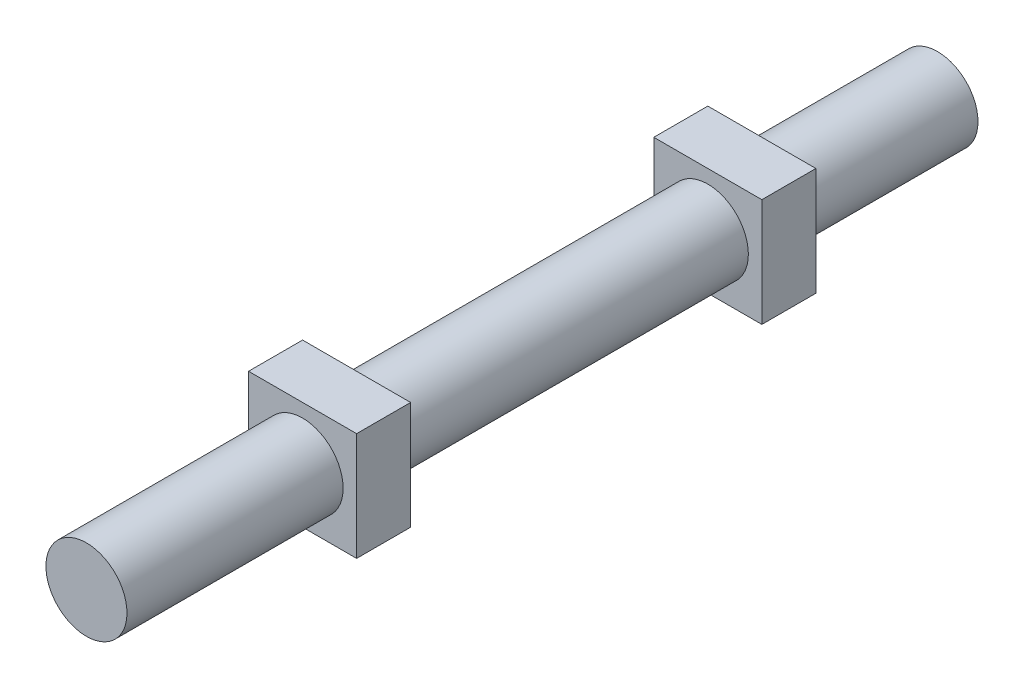
ISO-10303-21;
HEADER;
FILE_DESCRIPTION(('STEP AP214'),'2;1');
FILE_NAME('part.step','',(''),(''),'','','');
FILE_SCHEMA(('AUTOMOTIVE_DESIGN { 1 0 10303 214 1 1 1 1 }'));
ENDSEC;
DATA;
#1=APPLICATION_CONTEXT('core data for automotive mechanical design processes');
#2=APPLICATION_PROTOCOL_DEFINITION('international standard','automotive_design',2000,#1);
#3=PRODUCT_CONTEXT('',#1,'mechanical');
#4=PRODUCT('Part','Part','',(#3));
#5=PRODUCT_RELATED_PRODUCT_CATEGORY('part','',(#4));
#6=PRODUCT_DEFINITION_FORMATION('','',#4);
#7=PRODUCT_DEFINITION_CONTEXT('part definition',#1,'design');
#8=PRODUCT_DEFINITION('design','',#6,#7);
#9=PRODUCT_DEFINITION_SHAPE('','',#8);
#10=(LENGTH_UNIT() NAMED_UNIT(*) SI_UNIT(.MILLI.,.METRE.));
#11=(NAMED_UNIT(*) PLANE_ANGLE_UNIT() SI_UNIT($,.RADIAN.));
#12=(NAMED_UNIT(*) SI_UNIT($,.STERADIAN.) SOLID_ANGLE_UNIT());
#13=UNCERTAINTY_MEASURE_WITH_UNIT(LENGTH_MEASURE(1.E-05),#10,'distance_accuracy_value','');
#14=(GEOMETRIC_REPRESENTATION_CONTEXT(3) GLOBAL_UNCERTAINTY_ASSIGNED_CONTEXT((#13)) GLOBAL_UNIT_ASSIGNED_CONTEXT((#10,
#11,#12)) REPRESENTATION_CONTEXT('',''));
#15=CARTESIAN_POINT('',(0.,0.,0.));
#16=DIRECTION('',(0.,0.,1.));
#17=DIRECTION('',(1.,0.,0.));
#18=AXIS2_PLACEMENT_3D('',#15,#16,#17);
#19=CARTESIAN_POINT('',(0.,0.,157.5));
#20=DIRECTION('',(0.,0.,-1.));
#21=DIRECTION('',(-1.,0.,0.));
#22=AXIS2_PLACEMENT_3D('',#19,#20,#21);
#23=CYLINDRICAL_SURFACE('',#22,7.5);
#24=CARTESIAN_POINT('',(0.,0.,117.5));
#25=DIRECTION('',(0.,0.,1.));
#26=DIRECTION('',(1.,0.,0.));
#27=AXIS2_PLACEMENT_3D('',#24,#25,#26);
#28=CIRCLE('',#27,7.5);
#29=CARTESIAN_POINT('',(7.5,0.,117.5));
#30=VERTEX_POINT('',#29);
#31=EDGE_CURVE('E171',#30,#30,#28,.T.);
#32=ORIENTED_EDGE('',*,*,#31,.T.);
#33=EDGE_LOOP('',(#32));
#34=FACE_BOUND('',#33,.T.);
#35=CARTESIAN_POINT('',(0.,0.,157.5));
#36=DIRECTION('',(0.,0.,1.));
#37=DIRECTION('',(1.,0.,0.));
#38=AXIS2_PLACEMENT_3D('',#35,#36,#37);
#39=CIRCLE('',#38,7.5);
#40=CARTESIAN_POINT('',(7.5,0.,157.5));
#41=VERTEX_POINT('',#40);
#42=EDGE_CURVE('E172',#41,#41,#39,.T.);
#43=ORIENTED_EDGE('',*,*,#42,.F.);
#44=EDGE_LOOP('',(#43));
#45=FACE_BOUND('',#44,.T.);
#46=ADVANCED_FACE('F43',(#34,#45),#23,.T.);
#47=CARTESIAN_POINT('',(0.,0.,157.5));
#48=DIRECTION('',(0.,0.,1.));
#49=DIRECTION('',(1.,0.,0.));
#50=AXIS2_PLACEMENT_3D('',#47,#48,#49);
#51=PLANE('',#50);
#52=ORIENTED_EDGE('',*,*,#42,.T.);
#53=EDGE_LOOP('',(#52));
#54=FACE_BOUND('',#53,.T.);
#55=ADVANCED_FACE('F211',(#54),#51,.T.);
#56=CARTESIAN_POINT('',(10.,10.,117.5));
#57=DIRECTION('',(-1.,0.,0.));
#58=DIRECTION('',(0.,0.,1.));
#59=AXIS2_PLACEMENT_3D('',#56,#57,#58);
#60=PLANE('',#59);
#61=DIRECTION('',(0.,1.,0.));
#62=VECTOR('',#61,1.);
#63=CARTESIAN_POINT('',(10.,10.,107.5));
#64=LINE('',#63,#62);
#65=CARTESIAN_POINT('',(10.,-10.,107.5));
#66=VERTEX_POINT('',#65);
#67=CARTESIAN_POINT('',(10.,10.,107.5));
#68=VERTEX_POINT('',#67);
#69=EDGE_CURVE('E146',#66,#68,#64,.T.);
#70=ORIENTED_EDGE('',*,*,#69,.T.);
#71=DIRECTION('',(0.,0.,-1.));
#72=VECTOR('',#71,1.);
#73=CARTESIAN_POINT('',(10.,10.,117.5));
#74=LINE('',#73,#72);
#75=CARTESIAN_POINT('',(10.,10.,117.5));
#76=VERTEX_POINT('',#75);
#77=EDGE_CURVE('E169',#76,#68,#74,.T.);
#78=ORIENTED_EDGE('',*,*,#77,.F.);
#79=DIRECTION('',(0.,1.,0.));
#80=VECTOR('',#79,1.);
#81=CARTESIAN_POINT('',(10.,10.,117.5));
#82=LINE('',#81,#80);
#83=CARTESIAN_POINT('',(10.,-10.,117.5));
#84=VERTEX_POINT('',#83);
#85=EDGE_CURVE('E151',#84,#76,#82,.T.);
#86=ORIENTED_EDGE('',*,*,#85,.F.);
#87=DIRECTION('',(0.,0.,-1.));
#88=VECTOR('',#87,1.);
#89=CARTESIAN_POINT('',(10.,-10.,117.5));
#90=LINE('',#89,#88);
#91=EDGE_CURVE('E157',#84,#66,#90,.T.);
#92=ORIENTED_EDGE('',*,*,#91,.T.);
#93=EDGE_LOOP('',(#70,#78,#86,#92));
#94=FACE_BOUND('',#93,.T.);
#95=ADVANCED_FACE('F193',(#94),#60,.F.);
#96=CARTESIAN_POINT('',(-10.,10.,117.5));
#97=DIRECTION('',(0.,-1.,0.));
#98=DIRECTION('',(0.,0.,-1.));
#99=AXIS2_PLACEMENT_3D('',#96,#97,#98);
#100=PLANE('',#99);
#101=DIRECTION('',(-1.,0.,0.));
#102=VECTOR('',#101,1.);
#103=CARTESIAN_POINT('',(-10.,10.,107.5));
#104=LINE('',#103,#102);
#105=CARTESIAN_POINT('',(-10.,10.,107.5));
#106=VERTEX_POINT('',#105);
#107=EDGE_CURVE('E160',#68,#106,#104,.T.);
#108=ORIENTED_EDGE('',*,*,#107,.T.);
#109=DIRECTION('',(0.,0.,-1.));
#110=VECTOR('',#109,1.);
#111=CARTESIAN_POINT('',(-10.,10.,117.5));
#112=LINE('',#111,#110);
#113=CARTESIAN_POINT('',(-10.,10.,117.5));
#114=VERTEX_POINT('',#113);
#115=EDGE_CURVE('E167',#114,#106,#112,.T.);
#116=ORIENTED_EDGE('',*,*,#115,.F.);
#117=DIRECTION('',(-1.,0.,0.));
#118=VECTOR('',#117,1.);
#119=CARTESIAN_POINT('',(-10.,10.,117.5));
#120=LINE('',#119,#118);
#121=EDGE_CURVE('E92',#76,#114,#120,.T.);
#122=ORIENTED_EDGE('',*,*,#121,.F.);
#123=ORIENTED_EDGE('',*,*,#77,.T.);
#124=EDGE_LOOP('',(#108,#116,#122,#123));
#125=FACE_BOUND('',#124,.T.);
#126=ADVANCED_FACE('F195',(#125),#100,.F.);
#127=CARTESIAN_POINT('',(-10.,10.,117.5));
#128=DIRECTION('',(1.,0.,0.));
#129=DIRECTION('',(0.,1.,0.));
#130=AXIS2_PLACEMENT_3D('',#127,#128,#129);
#131=PLANE('',#130);
#132=DIRECTION('',(0.,-1.,0.));
#133=VECTOR('',#132,1.);
#134=CARTESIAN_POINT('',(-10.,10.,107.5));
#135=LINE('',#134,#133);
#136=CARTESIAN_POINT('',(-10.,-10.,107.5));
#137=VERTEX_POINT('',#136);
#138=EDGE_CURVE('E78',#106,#137,#135,.T.);
#139=ORIENTED_EDGE('',*,*,#138,.T.);
#140=DIRECTION('',(0.,0.,-1.));
#141=VECTOR('',#140,1.);
#142=CARTESIAN_POINT('',(-10.,-10.,117.5));
#143=LINE('',#142,#141);
#144=CARTESIAN_POINT('',(-10.,-10.,117.5));
#145=VERTEX_POINT('',#144);
#146=EDGE_CURVE('E165',#145,#137,#143,.T.);
#147=ORIENTED_EDGE('',*,*,#146,.F.);
#148=DIRECTION('',(0.,-1.,0.));
#149=VECTOR('',#148,1.);
#150=CARTESIAN_POINT('',(-10.,10.,117.5));
#151=LINE('',#150,#149);
#152=EDGE_CURVE('E154',#114,#145,#151,.T.);
#153=ORIENTED_EDGE('',*,*,#152,.F.);
#154=ORIENTED_EDGE('',*,*,#115,.T.);
#155=EDGE_LOOP('',(#139,#147,#153,#154));
#156=FACE_BOUND('',#155,.T.);
#157=ADVANCED_FACE('F198',(#156),#131,.F.);
#158=CARTESIAN_POINT('',(-10.,-10.,117.5));
#159=DIRECTION('',(0.,1.,0.));
#160=DIRECTION('',(0.,0.,1.));
#161=AXIS2_PLACEMENT_3D('',#158,#159,#160);
#162=PLANE('',#161);
#163=DIRECTION('',(1.,0.,0.));
#164=VECTOR('',#163,1.);
#165=CARTESIAN_POINT('',(-10.,-10.,107.5));
#166=LINE('',#165,#164);
#167=EDGE_CURVE('E84',#137,#66,#166,.T.);
#168=ORIENTED_EDGE('',*,*,#167,.T.);
#169=ORIENTED_EDGE('',*,*,#91,.F.);
#170=DIRECTION('',(1.,0.,0.));
#171=VECTOR('',#170,1.);
#172=CARTESIAN_POINT('',(-10.,-10.,117.5));
#173=LINE('',#172,#171);
#174=EDGE_CURVE('E60',#145,#84,#173,.T.);
#175=ORIENTED_EDGE('',*,*,#174,.F.);
#176=ORIENTED_EDGE('',*,*,#146,.T.);
#177=EDGE_LOOP('',(#168,#169,#175,#176));
#178=FACE_BOUND('',#177,.T.);
#179=ADVANCED_FACE('F188',(#178),#162,.F.);
#180=CARTESIAN_POINT('',(0.,0.,117.5));
#181=DIRECTION('',(0.,0.,1.));
#182=DIRECTION('',(1.,0.,0.));
#183=AXIS2_PLACEMENT_3D('',#180,#181,#182);
#184=PLANE('',#183);
#185=ORIENTED_EDGE('',*,*,#31,.F.);
#186=EDGE_LOOP('',(#185));
#187=FACE_BOUND('',#186,.T.);
#188=ORIENTED_EDGE('',*,*,#85,.T.);
#189=ORIENTED_EDGE('',*,*,#121,.T.);
#190=ORIENTED_EDGE('',*,*,#152,.T.);
#191=ORIENTED_EDGE('',*,*,#174,.T.);
#192=EDGE_LOOP('',(#188,#189,#190,#191));
#193=FACE_BOUND('',#192,.T.);
#194=ADVANCED_FACE('F185',(#187,#193),#184,.T.);
#195=CARTESIAN_POINT('',(0.,0.,107.5));
#196=DIRECTION('',(0.,0.,1.));
#197=DIRECTION('',(1.,0.,0.));
#198=AXIS2_PLACEMENT_3D('',#195,#196,#197);
#199=PLANE('',#198);
#200=CARTESIAN_POINT('',(0.,0.,107.5));
#201=DIRECTION('',(0.,0.,1.));
#202=DIRECTION('',(1.,0.,0.));
#203=AXIS2_PLACEMENT_3D('',#200,#201,#202);
#204=CIRCLE('',#203,7.5);
#205=CARTESIAN_POINT('',(7.5,0.,107.5));
#206=VERTEX_POINT('',#205);
#207=EDGE_CURVE('E52',#206,#206,#204,.T.);
#208=ORIENTED_EDGE('',*,*,#207,.T.);
#209=EDGE_LOOP('',(#208));
#210=FACE_BOUND('',#209,.T.);
#211=ORIENTED_EDGE('',*,*,#69,.F.);
#212=ORIENTED_EDGE('',*,*,#167,.F.);
#213=ORIENTED_EDGE('',*,*,#138,.F.);
#214=ORIENTED_EDGE('',*,*,#107,.F.);
#215=EDGE_LOOP('',(#211,#212,#213,#214));
#216=FACE_BOUND('',#215,.T.);
#217=ADVANCED_FACE('F187',(#210,#216),#199,.F.);
#218=CARTESIAN_POINT('',(0.,0.,42.5));
#219=DIRECTION('',(0.,0.,1.));
#220=DIRECTION('',(1.,0.,0.));
#221=AXIS2_PLACEMENT_3D('',#218,#219,#220);
#222=CIRCLE('',#221,7.5);
#223=CARTESIAN_POINT('',(7.5,0.,42.5));
#224=VERTEX_POINT('',#223);
#225=EDGE_CURVE('E46',#224,#224,#222,.T.);
#226=ORIENTED_EDGE('',*,*,#225,.T.);
#227=EDGE_LOOP('',(#226));
#228=FACE_BOUND('',#227,.T.);
#229=ORIENTED_EDGE('',*,*,#207,.F.);
#230=EDGE_LOOP('',(#229));
#231=FACE_BOUND('',#230,.T.);
#232=ADVANCED_FACE('F200',(#228,#231),#23,.T.);
#233=CARTESIAN_POINT('',(10.,10.,42.5));
#234=DIRECTION('',(-1.,0.,0.));
#235=DIRECTION('',(0.,0.,1.));
#236=AXIS2_PLACEMENT_3D('',#233,#234,#235);
#237=PLANE('',#236);
#238=DIRECTION('',(0.,1.,0.));
#239=VECTOR('',#238,1.);
#240=CARTESIAN_POINT('',(10.,10.,32.5));
#241=LINE('',#240,#239);
#242=CARTESIAN_POINT('',(10.,-10.,32.5));
#243=VERTEX_POINT('',#242);
#244=CARTESIAN_POINT('',(10.,10.,32.5));
#245=VERTEX_POINT('',#244);
#246=EDGE_CURVE('E143',#243,#245,#241,.T.);
#247=ORIENTED_EDGE('',*,*,#246,.T.);
#248=DIRECTION('',(0.,0.,-1.));
#249=VECTOR('',#248,1.);
#250=CARTESIAN_POINT('',(10.,10.,42.5));
#251=LINE('',#250,#249);
#252=CARTESIAN_POINT('',(10.,10.,42.5));
#253=VERTEX_POINT('',#252);
#254=EDGE_CURVE('E123',#253,#245,#251,.T.);
#255=ORIENTED_EDGE('',*,*,#254,.F.);
#256=DIRECTION('',(0.,1.,0.));
#257=VECTOR('',#256,1.);
#258=CARTESIAN_POINT('',(10.,10.,42.5));
#259=LINE('',#258,#257);
#260=CARTESIAN_POINT('',(10.,-10.,42.5));
#261=VERTEX_POINT('',#260);
#262=EDGE_CURVE('E130',#261,#253,#259,.T.);
#263=ORIENTED_EDGE('',*,*,#262,.F.);
#264=DIRECTION('',(0.,0.,-1.));
#265=VECTOR('',#264,1.);
#266=CARTESIAN_POINT('',(10.,-10.,42.5));
#267=LINE('',#266,#265);
#268=EDGE_CURVE('E245',#261,#243,#267,.T.);
#269=ORIENTED_EDGE('',*,*,#268,.T.);
#270=EDGE_LOOP('',(#247,#255,#263,#269));
#271=FACE_BOUND('',#270,.T.);
#272=ADVANCED_FACE('F141',(#271),#237,.F.);
#273=CARTESIAN_POINT('',(-10.,10.,42.5));
#274=DIRECTION('',(0.,-1.,0.));
#275=DIRECTION('',(0.,0.,-1.));
#276=AXIS2_PLACEMENT_3D('',#273,#274,#275);
#277=PLANE('',#276);
#278=DIRECTION('',(-1.,0.,0.));
#279=VECTOR('',#278,1.);
#280=CARTESIAN_POINT('',(-10.,10.,32.5));
#281=LINE('',#280,#279);
#282=CARTESIAN_POINT('',(-10.,10.,32.5));
#283=VERTEX_POINT('',#282);
#284=EDGE_CURVE('E236',#245,#283,#281,.T.);
#285=ORIENTED_EDGE('',*,*,#284,.T.);
#286=DIRECTION('',(0.,0.,-1.));
#287=VECTOR('',#286,1.);
#288=CARTESIAN_POINT('',(-10.,10.,42.5));
#289=LINE('',#288,#287);
#290=CARTESIAN_POINT('',(-10.,10.,42.5));
#291=VERTEX_POINT('',#290);
#292=EDGE_CURVE('E126',#291,#283,#289,.T.);
#293=ORIENTED_EDGE('',*,*,#292,.F.);
#294=DIRECTION('',(-1.,0.,0.));
#295=VECTOR('',#294,1.);
#296=CARTESIAN_POINT('',(-10.,10.,42.5));
#297=LINE('',#296,#295);
#298=EDGE_CURVE('E119',#253,#291,#297,.T.);
#299=ORIENTED_EDGE('',*,*,#298,.F.);
#300=ORIENTED_EDGE('',*,*,#254,.T.);
#301=EDGE_LOOP('',(#285,#293,#299,#300));
#302=FACE_BOUND('',#301,.T.);
#303=ADVANCED_FACE('F121',(#302),#277,.F.);
#304=CARTESIAN_POINT('',(-10.,10.,42.5));
#305=DIRECTION('',(1.,0.,0.));
#306=DIRECTION('',(0.,0.,-1.));
#307=AXIS2_PLACEMENT_3D('',#304,#305,#306);
#308=PLANE('',#307);
#309=DIRECTION('',(0.,-1.,0.));
#310=VECTOR('',#309,1.);
#311=CARTESIAN_POINT('',(-10.,10.,32.5));
#312=LINE('',#311,#310);
#313=CARTESIAN_POINT('',(-10.,-10.,32.5));
#314=VERTEX_POINT('',#313);
#315=EDGE_CURVE('E238',#283,#314,#312,.T.);
#316=ORIENTED_EDGE('',*,*,#315,.T.);
#317=DIRECTION('',(0.,0.,-1.));
#318=VECTOR('',#317,1.);
#319=CARTESIAN_POINT('',(-10.,-10.,42.5));
#320=LINE('',#319,#318);
#321=CARTESIAN_POINT('',(-10.,-10.,42.5));
#322=VERTEX_POINT('',#321);
#323=EDGE_CURVE('E147',#322,#314,#320,.T.);
#324=ORIENTED_EDGE('',*,*,#323,.F.);
#325=DIRECTION('',(0.,-1.,0.));
#326=VECTOR('',#325,1.);
#327=CARTESIAN_POINT('',(-10.,10.,42.5));
#328=LINE('',#327,#326);
#329=EDGE_CURVE('E129',#291,#322,#328,.T.);
#330=ORIENTED_EDGE('',*,*,#329,.F.);
#331=ORIENTED_EDGE('',*,*,#292,.T.);
#332=EDGE_LOOP('',(#316,#324,#330,#331));
#333=FACE_BOUND('',#332,.T.);
#334=ADVANCED_FACE('F251',(#333),#308,.F.);
#335=CARTESIAN_POINT('',(-10.,-10.,42.5));
#336=DIRECTION('',(0.,1.,0.));
#337=DIRECTION('',(0.,0.,1.));
#338=AXIS2_PLACEMENT_3D('',#335,#336,#337);
#339=PLANE('',#338);
#340=DIRECTION('',(1.,0.,0.));
#341=VECTOR('',#340,1.);
#342=CARTESIAN_POINT('',(-10.,-10.,32.5));
#343=LINE('',#342,#341);
#344=EDGE_CURVE('E139',#314,#243,#343,.T.);
#345=ORIENTED_EDGE('',*,*,#344,.T.);
#346=ORIENTED_EDGE('',*,*,#268,.F.);
#347=DIRECTION('',(1.,0.,0.));
#348=VECTOR('',#347,1.);
#349=CARTESIAN_POINT('',(-10.,-10.,42.5));
#350=LINE('',#349,#348);
#351=EDGE_CURVE('E135',#322,#261,#350,.T.);
#352=ORIENTED_EDGE('',*,*,#351,.F.);
#353=ORIENTED_EDGE('',*,*,#323,.T.);
#354=EDGE_LOOP('',(#345,#346,#352,#353));
#355=FACE_BOUND('',#354,.T.);
#356=ADVANCED_FACE('F249',(#355),#339,.F.);
#357=CARTESIAN_POINT('',(0.,0.,42.5));
#358=DIRECTION('',(0.,0.,1.));
#359=DIRECTION('',(1.,0.,0.));
#360=AXIS2_PLACEMENT_3D('',#357,#358,#359);
#361=PLANE('',#360);
#362=ORIENTED_EDGE('',*,*,#225,.F.);
#363=EDGE_LOOP('',(#362));
#364=FACE_BOUND('',#363,.T.);
#365=ORIENTED_EDGE('',*,*,#262,.T.);
#366=ORIENTED_EDGE('',*,*,#298,.T.);
#367=ORIENTED_EDGE('',*,*,#329,.T.);
#368=ORIENTED_EDGE('',*,*,#351,.T.);
#369=EDGE_LOOP('',(#365,#366,#367,#368));
#370=FACE_BOUND('',#369,.T.);
#371=ADVANCED_FACE('F133',(#364,#370),#361,.T.);
#372=CARTESIAN_POINT('',(0.,0.,32.5));
#373=DIRECTION('',(0.,0.,1.));
#374=DIRECTION('',(1.,0.,0.));
#375=AXIS2_PLACEMENT_3D('',#372,#373,#374);
#376=PLANE('',#375);
#377=CARTESIAN_POINT('',(0.,0.,32.5));
#378=DIRECTION('',(0.,0.,1.));
#379=DIRECTION('',(1.,0.,0.));
#380=AXIS2_PLACEMENT_3D('',#377,#378,#379);
#381=CIRCLE('',#380,7.5);
#382=CARTESIAN_POINT('',(7.5,0.,32.5));
#383=VERTEX_POINT('',#382);
#384=EDGE_CURVE('E11',#383,#383,#381,.T.);
#385=ORIENTED_EDGE('',*,*,#384,.T.);
#386=EDGE_LOOP('',(#385));
#387=FACE_BOUND('',#386,.T.);
#388=ORIENTED_EDGE('',*,*,#246,.F.);
#389=ORIENTED_EDGE('',*,*,#344,.F.);
#390=ORIENTED_EDGE('',*,*,#315,.F.);
#391=ORIENTED_EDGE('',*,*,#284,.F.);
#392=EDGE_LOOP('',(#388,#389,#390,#391));
#393=FACE_BOUND('',#392,.T.);
#394=ADVANCED_FACE('F225',(#387,#393),#376,.F.);
#395=CARTESIAN_POINT('',(0.,0.,0.));
#396=DIRECTION('',(0.,0.,1.));
#397=DIRECTION('',(1.,0.,0.));
#398=AXIS2_PLACEMENT_3D('',#395,#396,#397);
#399=PLANE('',#398);
#400=CARTESIAN_POINT('',(0.,0.,0.));
#401=DIRECTION('',(0.,0.,1.));
#402=DIRECTION('',(1.,0.,0.));
#403=AXIS2_PLACEMENT_3D('',#400,#401,#402);
#404=CIRCLE('',#403,7.5);
#405=CARTESIAN_POINT('',(7.5,0.,0.));
#406=VERTEX_POINT('',#405);
#407=EDGE_CURVE('E175',#406,#406,#404,.T.);
#408=ORIENTED_EDGE('',*,*,#407,.F.);
#409=EDGE_LOOP('',(#408));
#410=FACE_BOUND('',#409,.T.);
#411=ADVANCED_FACE('F220',(#410),#399,.F.);
#412=ORIENTED_EDGE('',*,*,#407,.T.);
#413=EDGE_LOOP('',(#412));
#414=FACE_BOUND('',#413,.T.);
#415=ORIENTED_EDGE('',*,*,#384,.F.);
#416=EDGE_LOOP('',(#415));
#417=FACE_BOUND('',#416,.T.);
#418=ADVANCED_FACE('F208',(#414,#417),#23,.T.);
#419=CLOSED_SHELL('',(#46,#55,#95,#126,#157,#179,#194,#217,#232,#272,#303,#334,#356,#371,#394,
#411,#418));
#420=MANIFOLD_SOLID_BREP('B2',#419);
#421=ADVANCED_BREP_SHAPE_REPRESENTATION('',(#18,#420),#14);
#422=SHAPE_DEFINITION_REPRESENTATION(#9,#421);
ENDSEC;
END-ISO-10303-21;
